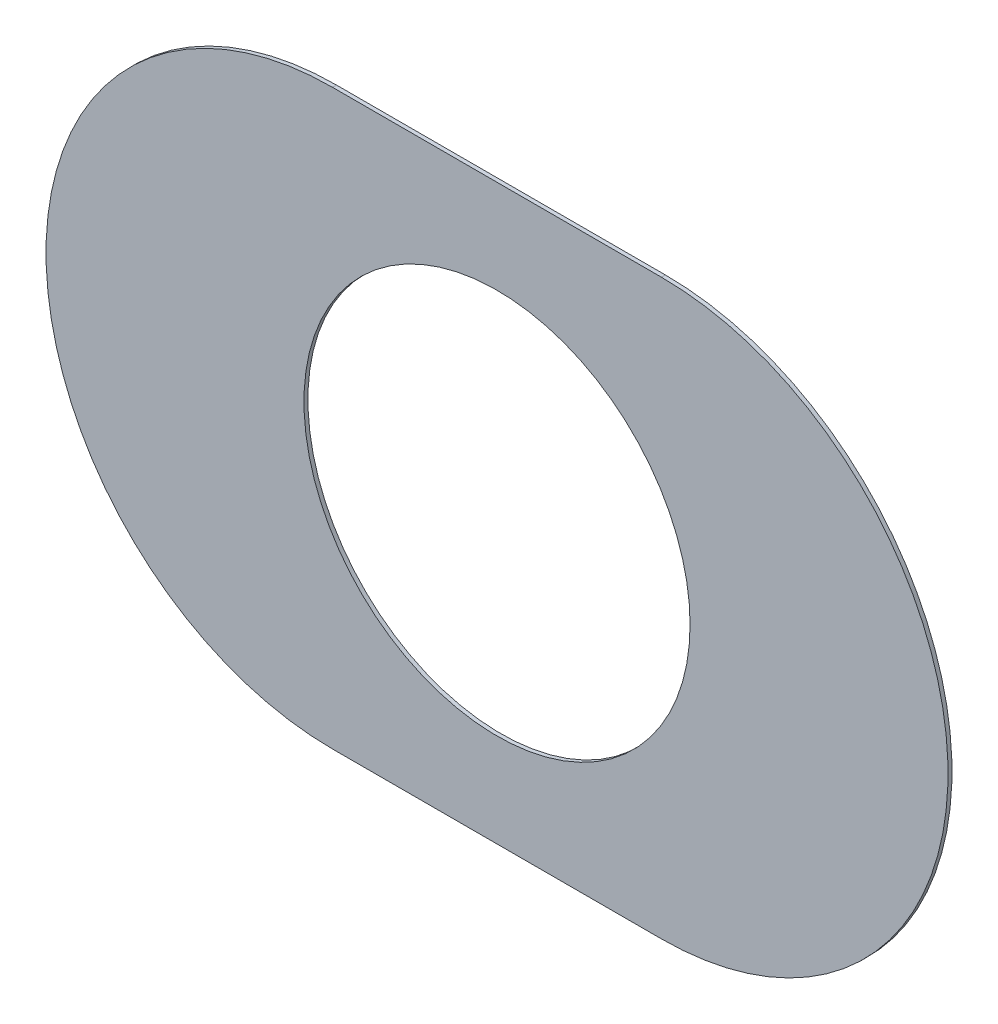
ISO-10303-21;
HEADER;
FILE_DESCRIPTION(('STEP AP214'),'2;1');
FILE_NAME('part.step','',(''),(''),'','','');
FILE_SCHEMA(('AUTOMOTIVE_DESIGN { 1 0 10303 214 1 1 1 1 }'));
ENDSEC;
DATA;
#1=APPLICATION_CONTEXT('core data for automotive mechanical design processes');
#2=APPLICATION_PROTOCOL_DEFINITION('international standard','automotive_design',2000,#1);
#3=PRODUCT_CONTEXT('',#1,'mechanical');
#4=PRODUCT('Part','Part','',(#3));
#5=PRODUCT_RELATED_PRODUCT_CATEGORY('part','',(#4));
#6=PRODUCT_DEFINITION_FORMATION('','',#4);
#7=PRODUCT_DEFINITION_CONTEXT('part definition',#1,'design');
#8=PRODUCT_DEFINITION('design','',#6,#7);
#9=PRODUCT_DEFINITION_SHAPE('','',#8);
#10=(LENGTH_UNIT() NAMED_UNIT(*) SI_UNIT(.MILLI.,.METRE.));
#11=(NAMED_UNIT(*) PLANE_ANGLE_UNIT() SI_UNIT($,.RADIAN.));
#12=(NAMED_UNIT(*) SI_UNIT($,.STERADIAN.) SOLID_ANGLE_UNIT());
#13=UNCERTAINTY_MEASURE_WITH_UNIT(LENGTH_MEASURE(1.E-05),#10,'distance_accuracy_value','');
#14=(GEOMETRIC_REPRESENTATION_CONTEXT(3) GLOBAL_UNCERTAINTY_ASSIGNED_CONTEXT((#13)) GLOBAL_UNIT_ASSIGNED_CONTEXT((#10,
#11,#12)) REPRESENTATION_CONTEXT('',''));
#15=CARTESIAN_POINT('',(0.,0.,0.));
#16=DIRECTION('',(0.,0.,1.));
#17=DIRECTION('',(1.,0.,0.));
#18=AXIS2_PLACEMENT_3D('',#15,#16,#17);
#19=CARTESIAN_POINT('',(24.3000003427268,34.8600006854535,0.));
#20=DIRECTION('',(0.,0.,1.));
#21=DIRECTION('',(1.,0.,0.));
#22=AXIS2_PLACEMENT_3D('',#19,#20,#21);
#23=PLANE('',#22);
#24=CARTESIAN_POINT('',(24.3000003427268,34.8600006854535,0.));
#25=DIRECTION('',(0.,0.,-1.));
#26=DIRECTION('',(-1.,0.,0.));
#27=AXIS2_PLACEMENT_3D('',#24,#25,#26);
#28=CIRCLE('',#27,0.49);
#29=CARTESIAN_POINT('',(24.7900003427268,34.8600006854535,0.));
#30=VERTEX_POINT('',#29);
#31=EDGE_CURVE('E78',#30,#30,#28,.T.);
#32=ORIENTED_EDGE('',*,*,#31,.T.);
#33=EDGE_LOOP('',(#32));
#34=FACE_BOUND('',#33,.T.);
#35=CARTESIAN_POINT('',(23.8825938881802,34.8600006854535,0.));
#36=DIRECTION('',(0.,0.,1.));
#37=DIRECTION('',(0.,1.,0.));
#38=AXIS2_PLACEMENT_3D('',#35,#36,#37);
#39=CIRCLE('',#38,0.727257121659981);
#40=CARTESIAN_POINT('',(23.8825938881802,35.5872578071135,0.));
#41=VERTEX_POINT('',#40);
#42=CARTESIAN_POINT('',(23.8825938881802,34.1327435637935,0.));
#43=VERTEX_POINT('',#42);
#44=EDGE_CURVE('E28',#41,#43,#39,.T.);
#45=ORIENTED_EDGE('',*,*,#44,.T.);
#46=DIRECTION('',(1.,0.,0.));
#47=VECTOR('',#46,1.);
#48=CARTESIAN_POINT('',(23.8825938881802,34.1327435637935,0.));
#49=LINE('',#48,#47);
#50=CARTESIAN_POINT('',(24.7174067972734,34.1327435637935,0.));
#51=VERTEX_POINT('',#50);
#52=EDGE_CURVE('E115',#43,#51,#49,.T.);
#53=ORIENTED_EDGE('',*,*,#52,.T.);
#54=CARTESIAN_POINT('',(24.7174067972734,34.8600006854535,0.));
#55=DIRECTION('',(0.,0.,1.));
#56=DIRECTION('',(0.,-1.,0.));
#57=AXIS2_PLACEMENT_3D('',#54,#55,#56);
#58=CIRCLE('',#57,0.727257121659981);
#59=CARTESIAN_POINT('',(24.7174067972734,35.5872578071135,0.));
#60=VERTEX_POINT('',#59);
#61=EDGE_CURVE('E91',#51,#60,#58,.T.);
#62=ORIENTED_EDGE('',*,*,#61,.T.);
#63=DIRECTION('',(-1.,0.,0.));
#64=VECTOR('',#63,1.);
#65=CARTESIAN_POINT('',(24.7174067972734,35.5872578071135,0.));
#66=LINE('',#65,#64);
#67=EDGE_CURVE('E84',#60,#41,#66,.T.);
#68=ORIENTED_EDGE('',*,*,#67,.T.);
#69=EDGE_LOOP('',(#45,#53,#62,#68));
#70=FACE_BOUND('',#69,.T.);
#71=ADVANCED_FACE('F17',(#34,#70),#23,.T.);
#72=CARTESIAN_POINT('',(24.3000003427268,34.8600006854535,-0.01));
#73=DIRECTION('',(0.,0.,1.));
#74=DIRECTION('',(1.,0.,0.));
#75=AXIS2_PLACEMENT_3D('',#72,#73,#74);
#76=PLANE('',#75);
#77=CARTESIAN_POINT('',(24.3000003427268,34.8600006854535,-0.01));
#78=DIRECTION('',(0.,0.,-1.));
#79=DIRECTION('',(-1.,0.,0.));
#80=AXIS2_PLACEMENT_3D('',#77,#78,#79);
#81=CIRCLE('',#80,0.49);
#82=CARTESIAN_POINT('',(24.7900003427268,34.8600006854535,-0.01));
#83=VERTEX_POINT('',#82);
#84=EDGE_CURVE('E77',#83,#83,#81,.T.);
#85=ORIENTED_EDGE('',*,*,#84,.F.);
#86=EDGE_LOOP('',(#85));
#87=FACE_BOUND('',#86,.T.);
#88=CARTESIAN_POINT('',(23.8825938881802,34.8600006854535,-0.01));
#89=DIRECTION('',(0.,0.,1.));
#90=DIRECTION('',(0.,1.,0.));
#91=AXIS2_PLACEMENT_3D('',#88,#89,#90);
#92=CIRCLE('',#91,0.727257121659981);
#93=CARTESIAN_POINT('',(23.8825938881802,35.5872578071135,-0.01));
#94=VERTEX_POINT('',#93);
#95=CARTESIAN_POINT('',(23.8825938881802,34.1327435637935,-0.01));
#96=VERTEX_POINT('',#95);
#97=EDGE_CURVE('E11',#94,#96,#92,.T.);
#98=ORIENTED_EDGE('',*,*,#97,.F.);
#99=DIRECTION('',(-1.,0.,0.));
#100=VECTOR('',#99,1.);
#101=CARTESIAN_POINT('',(24.7174067972734,35.5872578071135,-0.01));
#102=LINE('',#101,#100);
#103=CARTESIAN_POINT('',(24.7174067972734,35.5872578071135,-0.01));
#104=VERTEX_POINT('',#103);
#105=EDGE_CURVE('E21',#104,#94,#102,.T.);
#106=ORIENTED_EDGE('',*,*,#105,.F.);
#107=CARTESIAN_POINT('',(24.7174067972734,34.8600006854535,-0.01));
#108=DIRECTION('',(0.,0.,1.));
#109=DIRECTION('',(0.,-1.,0.));
#110=AXIS2_PLACEMENT_3D('',#107,#108,#109);
#111=CIRCLE('',#110,0.727257121659981);
#112=CARTESIAN_POINT('',(24.7174067972734,34.1327435637935,-0.01));
#113=VERTEX_POINT('',#112);
#114=EDGE_CURVE('E104',#113,#104,#111,.T.);
#115=ORIENTED_EDGE('',*,*,#114,.F.);
#116=DIRECTION('',(1.,0.,0.));
#117=VECTOR('',#116,1.);
#118=CARTESIAN_POINT('',(23.8825938881802,34.1327435637935,-0.01));
#119=LINE('',#118,#117);
#120=EDGE_CURVE('E96',#96,#113,#119,.T.);
#121=ORIENTED_EDGE('',*,*,#120,.F.);
#122=EDGE_LOOP('',(#98,#106,#115,#121));
#123=FACE_BOUND('',#122,.T.);
#124=ADVANCED_FACE('F154',(#87,#123),#76,.F.);
#125=CARTESIAN_POINT('',(23.8825938881802,34.8600006854535,0.));
#126=DIRECTION('',(0.,0.,1.));
#127=DIRECTION('',(0.,1.,0.));
#128=AXIS2_PLACEMENT_3D('',#125,#126,#127);
#129=CYLINDRICAL_SURFACE('',#128,0.727257121659981);
#130=ORIENTED_EDGE('',*,*,#44,.F.);
#131=DIRECTION('',(0.,0.,-1.));
#132=VECTOR('',#131,1.);
#133=CARTESIAN_POINT('',(23.8825938881802,35.5872578071135,0.));
#134=LINE('',#133,#132);
#135=EDGE_CURVE('E89',#41,#94,#134,.T.);
#136=ORIENTED_EDGE('',*,*,#135,.T.);
#137=ORIENTED_EDGE('',*,*,#97,.T.);
#138=DIRECTION('',(0.,0.,-1.));
#139=VECTOR('',#138,1.);
#140=CARTESIAN_POINT('',(23.8825938881802,34.1327435637935,0.));
#141=LINE('',#140,#139);
#142=EDGE_CURVE('E99',#43,#96,#141,.T.);
#143=ORIENTED_EDGE('',*,*,#142,.F.);
#144=EDGE_LOOP('',(#130,#136,#137,#143));
#145=FACE_BOUND('',#144,.T.);
#146=ADVANCED_FACE('F137',(#145),#129,.T.);
#147=CARTESIAN_POINT('',(23.8825938881802,34.1327435637935,0.));
#148=DIRECTION('',(0.,1.,0.));
#149=DIRECTION('',(1.,0.,0.));
#150=AXIS2_PLACEMENT_3D('',#147,#148,#149);
#151=PLANE('',#150);
#152=ORIENTED_EDGE('',*,*,#52,.F.);
#153=ORIENTED_EDGE('',*,*,#142,.T.);
#154=ORIENTED_EDGE('',*,*,#120,.T.);
#155=DIRECTION('',(0.,0.,-1.));
#156=VECTOR('',#155,1.);
#157=CARTESIAN_POINT('',(24.7174067972734,34.1327435637935,0.));
#158=LINE('',#157,#156);
#159=EDGE_CURVE('E100',#51,#113,#158,.T.);
#160=ORIENTED_EDGE('',*,*,#159,.F.);
#161=EDGE_LOOP('',(#152,#153,#154,#160));
#162=FACE_BOUND('',#161,.T.);
#163=ADVANCED_FACE('F127',(#162),#151,.F.);
#164=CARTESIAN_POINT('',(24.7174067972734,34.8600006854535,0.));
#165=DIRECTION('',(0.,0.,1.));
#166=DIRECTION('',(0.,-1.,0.));
#167=AXIS2_PLACEMENT_3D('',#164,#165,#166);
#168=CYLINDRICAL_SURFACE('',#167,0.727257121659981);
#169=ORIENTED_EDGE('',*,*,#61,.F.);
#170=ORIENTED_EDGE('',*,*,#159,.T.);
#171=ORIENTED_EDGE('',*,*,#114,.T.);
#172=DIRECTION('',(0.,0.,-1.));
#173=VECTOR('',#172,1.);
#174=CARTESIAN_POINT('',(24.7174067972734,35.5872578071135,0.));
#175=LINE('',#174,#173);
#176=EDGE_CURVE('E95',#60,#104,#175,.T.);
#177=ORIENTED_EDGE('',*,*,#176,.F.);
#178=EDGE_LOOP('',(#169,#170,#171,#177));
#179=FACE_BOUND('',#178,.T.);
#180=ADVANCED_FACE('F130',(#179),#168,.T.);
#181=CARTESIAN_POINT('',(24.7174067972734,35.5872578071135,0.));
#182=DIRECTION('',(0.,-1.,0.));
#183=DIRECTION('',(0.,0.,-1.));
#184=AXIS2_PLACEMENT_3D('',#181,#182,#183);
#185=PLANE('',#184);
#186=ORIENTED_EDGE('',*,*,#67,.F.);
#187=ORIENTED_EDGE('',*,*,#176,.T.);
#188=ORIENTED_EDGE('',*,*,#105,.T.);
#189=ORIENTED_EDGE('',*,*,#135,.F.);
#190=EDGE_LOOP('',(#186,#187,#188,#189));
#191=FACE_BOUND('',#190,.T.);
#192=ADVANCED_FACE('F136',(#191),#185,.F.);
#193=CARTESIAN_POINT('',(24.3000003427268,34.8600006854535,0.));
#194=DIRECTION('',(0.,0.,1.));
#195=DIRECTION('',(-1.,0.,0.));
#196=AXIS2_PLACEMENT_3D('',#193,#194,#195);
#197=CYLINDRICAL_SURFACE('',#196,0.49);
#198=ORIENTED_EDGE('',*,*,#84,.T.);
#199=DIRECTION('',(0.,0.,1.));
#200=VECTOR('',#199,1.);
#201=CARTESIAN_POINT('',(24.7900003427268,34.8600006854535,0.));
#202=LINE('',#201,#200);
#203=EDGE_CURVE('E75',#83,#30,#202,.T.);
#204=ORIENTED_EDGE('',*,*,#203,.T.);
#205=ORIENTED_EDGE('',*,*,#31,.F.);
#206=ORIENTED_EDGE('',*,*,#203,.F.);
#207=EDGE_LOOP('',(#198,#204,#205,#206));
#208=FACE_BOUND('',#207,.T.);
#209=ADVANCED_FACE('F19',(#208),#197,.F.);
#210=CLOSED_SHELL('',(#71,#124,#146,#163,#180,#192,#209));
#211=MANIFOLD_SOLID_BREP('B1',#210);
#212=ADVANCED_BREP_SHAPE_REPRESENTATION('',(#18,#211),#14);
#213=SHAPE_DEFINITION_REPRESENTATION(#9,#212);
ENDSEC;
END-ISO-10303-21;
